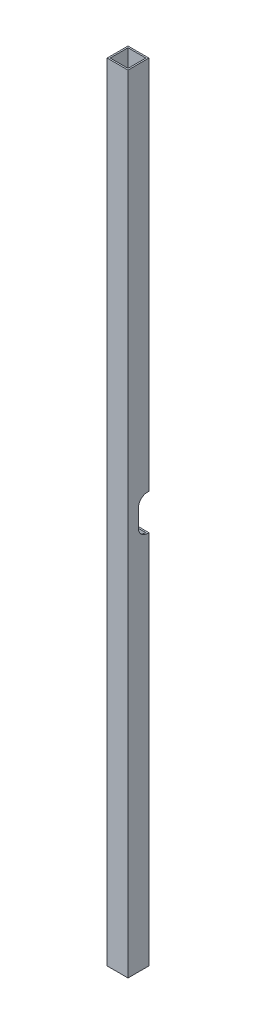
ISO-10303-21;
HEADER;
FILE_DESCRIPTION(('STEP AP214'),'2;1');
FILE_NAME('part.step','',(''),(''),'','','');
FILE_SCHEMA(('AUTOMOTIVE_DESIGN { 1 0 10303 214 1 1 1 1 }'));
ENDSEC;
DATA;
#1=APPLICATION_CONTEXT('core data for automotive mechanical design processes');
#2=APPLICATION_PROTOCOL_DEFINITION('international standard','automotive_design',2000,#1);
#3=PRODUCT_CONTEXT('',#1,'mechanical');
#4=PRODUCT('Part','Part','',(#3));
#5=PRODUCT_RELATED_PRODUCT_CATEGORY('part','',(#4));
#6=PRODUCT_DEFINITION_FORMATION('','',#4);
#7=PRODUCT_DEFINITION_CONTEXT('part definition',#1,'design');
#8=PRODUCT_DEFINITION('design','',#6,#7);
#9=PRODUCT_DEFINITION_SHAPE('','',#8);
#10=(LENGTH_UNIT() NAMED_UNIT(*) SI_UNIT(.MILLI.,.METRE.));
#11=(NAMED_UNIT(*) PLANE_ANGLE_UNIT() SI_UNIT($,.RADIAN.));
#12=(NAMED_UNIT(*) SI_UNIT($,.STERADIAN.) SOLID_ANGLE_UNIT());
#13=UNCERTAINTY_MEASURE_WITH_UNIT(LENGTH_MEASURE(1.E-05),#10,'distance_accuracy_value','');
#14=(GEOMETRIC_REPRESENTATION_CONTEXT(3) GLOBAL_UNCERTAINTY_ASSIGNED_CONTEXT((#13)) GLOBAL_UNIT_ASSIGNED_CONTEXT((#10,
#11,#12)) REPRESENTATION_CONTEXT('',''));
#15=CARTESIAN_POINT('',(0.,0.,0.));
#16=DIRECTION('',(0.,0.,1.));
#17=DIRECTION('',(1.,0.,0.));
#18=AXIS2_PLACEMENT_3D('',#15,#16,#17);
#19=CARTESIAN_POINT('',(657.225,-19.05,3.175));
#20=DIRECTION('',(1.,0.,0.));
#21=DIRECTION('',(0.,1.,0.));
#22=AXIS2_PLACEMENT_3D('',#19,#20,#21);
#23=CYLINDRICAL_SURFACE('',#22,19.05);
#24=DIRECTION('',(-1.,0.,0.));
#25=VECTOR('',#24,1.);
#26=CARTESIAN_POINT('',(657.225,-19.05,22.225));
#27=LINE('',#26,#25);
#28=CARTESIAN_POINT('',(704.85,-19.05,22.225));
#29=VERTEX_POINT('',#28);
#30=CARTESIAN_POINT('',(701.675,-19.05,22.225));
#31=VERTEX_POINT('',#30);
#32=EDGE_CURVE('E261',#29,#31,#27,.T.);
#33=ORIENTED_EDGE('',*,*,#32,.F.);
#34=CARTESIAN_POINT('',(704.85,-19.05,3.175));
#35=DIRECTION('',(1.,0.,0.));
#36=DIRECTION('',(0.,1.,0.));
#37=AXIS2_PLACEMENT_3D('',#34,#35,#36);
#38=CIRCLE('',#37,19.05);
#39=CARTESIAN_POINT('',(704.85,-38.1,3.175));
#40=VERTEX_POINT('',#39);
#41=EDGE_CURVE('E141',#40,#29,#38,.F.);
#42=ORIENTED_EDGE('',*,*,#41,.F.);
#43=DIRECTION('',(1.,0.,0.));
#44=VECTOR('',#43,1.);
#45=CARTESIAN_POINT('',(657.225,-38.1,3.175));
#46=LINE('',#45,#44);
#47=CARTESIAN_POINT('',(701.675,-38.1,3.175));
#48=VERTEX_POINT('',#47);
#49=EDGE_CURVE('E137',#48,#40,#46,.T.);
#50=ORIENTED_EDGE('',*,*,#49,.F.);
#51=CARTESIAN_POINT('',(701.675,-19.05,3.175));
#52=DIRECTION('',(1.,0.,0.));
#53=DIRECTION('',(0.,1.,0.));
#54=AXIS2_PLACEMENT_3D('',#51,#52,#53);
#55=CIRCLE('',#54,19.05);
#56=EDGE_CURVE('E17',#48,#31,#55,.F.);
#57=ORIENTED_EDGE('',*,*,#56,.T.);
#58=EDGE_LOOP('',(#33,#42,#50,#57));
#59=FACE_BOUND('',#58,.T.);
#60=ADVANCED_FACE('F14',(#59),#23,.F.);
#61=CARTESIAN_POINT('',(657.225,-2.9321578383444,22.225));
#62=DIRECTION('',(0.,0.,-1.));
#63=DIRECTION('',(-1.,0.,0.));
#64=AXIS2_PLACEMENT_3D('',#61,#62,#63);
#65=PLANE('',#64);
#66=DIRECTION('',(0.,1.,0.));
#67=VECTOR('',#66,1.);
#68=CARTESIAN_POINT('',(704.85,0.,22.225));
#69=LINE('',#68,#67);
#70=CARTESIAN_POINT('',(704.85,19.05,22.225));
#71=VERTEX_POINT('',#70);
#72=EDGE_CURVE('E206',#29,#71,#69,.T.);
#73=ORIENTED_EDGE('',*,*,#72,.F.);
#74=ORIENTED_EDGE('',*,*,#32,.T.);
#75=DIRECTION('',(0.,1.,0.));
#76=VECTOR('',#75,1.);
#77=CARTESIAN_POINT('',(701.675,0.,22.225));
#78=LINE('',#77,#76);
#79=CARTESIAN_POINT('',(701.675,19.05,22.225));
#80=VERTEX_POINT('',#79);
#81=EDGE_CURVE('E156',#31,#80,#78,.T.);
#82=ORIENTED_EDGE('',*,*,#81,.T.);
#83=DIRECTION('',(-1.,0.,0.));
#84=VECTOR('',#83,1.);
#85=CARTESIAN_POINT('',(657.225,19.05,22.225));
#86=LINE('',#85,#84);
#87=EDGE_CURVE('E147',#80,#71,#86,.F.);
#88=ORIENTED_EDGE('',*,*,#87,.T.);
#89=EDGE_LOOP('',(#73,#74,#82,#88));
#90=FACE_BOUND('',#89,.T.);
#91=ADVANCED_FACE('F392',(#90),#65,.T.);
#92=CARTESIAN_POINT('',(657.225,19.05,3.175));
#93=DIRECTION('',(-1.,0.,0.));
#94=DIRECTION('',(0.,-1.,0.));
#95=AXIS2_PLACEMENT_3D('',#92,#93,#94);
#96=CYLINDRICAL_SURFACE('',#95,19.05);
#97=DIRECTION('',(1.,0.,0.));
#98=VECTOR('',#97,1.);
#99=CARTESIAN_POINT('',(657.225,38.1,3.175));
#100=LINE('',#99,#98);
#101=CARTESIAN_POINT('',(701.675,38.1,3.175));
#102=VERTEX_POINT('',#101);
#103=CARTESIAN_POINT('',(704.85,38.1,3.175));
#104=VERTEX_POINT('',#103);
#105=EDGE_CURVE('E193',#102,#104,#100,.T.);
#106=ORIENTED_EDGE('',*,*,#105,.T.);
#107=CARTESIAN_POINT('',(704.85,19.05,3.175));
#108=DIRECTION('',(-1.,0.,0.));
#109=DIRECTION('',(0.,-1.,0.));
#110=AXIS2_PLACEMENT_3D('',#107,#108,#109);
#111=CIRCLE('',#110,19.05);
#112=EDGE_CURVE('E202',#71,#104,#111,.T.);
#113=ORIENTED_EDGE('',*,*,#112,.F.);
#114=ORIENTED_EDGE('',*,*,#87,.F.);
#115=CARTESIAN_POINT('',(701.675,19.05,3.175));
#116=DIRECTION('',(-1.,0.,0.));
#117=DIRECTION('',(0.,-1.,0.));
#118=AXIS2_PLACEMENT_3D('',#115,#116,#117);
#119=CIRCLE('',#118,19.05);
#120=EDGE_CURVE('E172',#80,#102,#119,.T.);
#121=ORIENTED_EDGE('',*,*,#120,.T.);
#122=EDGE_LOOP('',(#106,#113,#114,#121));
#123=FACE_BOUND('',#122,.T.);
#124=ADVANCED_FACE('F383',(#123),#96,.F.);
#125=CARTESIAN_POINT('',(352.425,0.,3.175));
#126=DIRECTION('',(0.,0.,1.));
#127=DIRECTION('',(1.,0.,0.));
#128=AXIS2_PLACEMENT_3D('',#125,#126,#127);
#129=PLANE('',#128);
#130=DIRECTION('',(1.,0.,0.));
#131=VECTOR('',#130,1.);
#132=CARTESIAN_POINT('',(682.625,838.2,3.175));
#133=LINE('',#132,#131);
#134=CARTESIAN_POINT('',(701.675,838.2,3.175));
#135=VERTEX_POINT('',#134);
#136=CARTESIAN_POINT('',(663.575,838.2,3.175));
#137=VERTEX_POINT('',#136);
#138=EDGE_CURVE('E187',#135,#137,#133,.F.);
#139=ORIENTED_EDGE('',*,*,#138,.T.);
#140=DIRECTION('',(0.,1.,0.));
#141=VECTOR('',#140,1.);
#142=CARTESIAN_POINT('',(663.575,0.,3.175));
#143=LINE('',#142,#141);
#144=CARTESIAN_POINT('',(663.575,38.1,3.175));
#145=VERTEX_POINT('',#144);
#146=EDGE_CURVE('E216',#145,#137,#143,.T.);
#147=ORIENTED_EDGE('',*,*,#146,.F.);
#148=DIRECTION('',(1.,0.,0.));
#149=VECTOR('',#148,1.);
#150=CARTESIAN_POINT('',(657.225,38.1,3.175));
#151=LINE('',#150,#149);
#152=EDGE_CURVE('E191',#145,#102,#151,.T.);
#153=ORIENTED_EDGE('',*,*,#152,.T.);
#154=DIRECTION('',(0.,1.,0.));
#155=VECTOR('',#154,1.);
#156=CARTESIAN_POINT('',(701.675,0.,3.175));
#157=LINE('',#156,#155);
#158=EDGE_CURVE('E170',#102,#135,#157,.T.);
#159=ORIENTED_EDGE('',*,*,#158,.T.);
#160=EDGE_LOOP('',(#139,#147,#153,#159));
#161=FACE_BOUND('',#160,.T.);
#162=ADVANCED_FACE('F381',(#161),#129,.T.);
#163=CARTESIAN_POINT('',(657.225,-38.1,10.495868107313));
#164=DIRECTION('',(0.,1.,0.));
#165=DIRECTION('',(0.,0.,1.));
#166=AXIS2_PLACEMENT_3D('',#163,#164,#165);
#167=PLANE('',#166);
#168=DIRECTION('',(0.,0.,1.));
#169=VECTOR('',#168,1.);
#170=CARTESIAN_POINT('',(660.4,-38.1,44.45));
#171=LINE('',#170,#169);
#172=CARTESIAN_POINT('',(660.4,-38.1,0.));
#173=VERTEX_POINT('',#172);
#174=CARTESIAN_POINT('',(660.4,-38.1,3.175));
#175=VERTEX_POINT('',#174);
#176=EDGE_CURVE('E201',#173,#175,#171,.T.);
#177=ORIENTED_EDGE('',*,*,#176,.T.);
#178=DIRECTION('',(1.,0.,0.));
#179=VECTOR('',#178,1.);
#180=CARTESIAN_POINT('',(657.225,-38.1,3.175));
#181=LINE('',#180,#179);
#182=CARTESIAN_POINT('',(663.575,-38.1,3.175));
#183=VERTEX_POINT('',#182);
#184=EDGE_CURVE('E146',#175,#183,#181,.T.);
#185=ORIENTED_EDGE('',*,*,#184,.T.);
#186=DIRECTION('',(1.,0.,0.));
#187=VECTOR('',#186,1.);
#188=CARTESIAN_POINT('',(352.425,-38.1,3.175));
#189=LINE('',#188,#187);
#190=EDGE_CURVE('E159',#48,#183,#189,.F.);
#191=ORIENTED_EDGE('',*,*,#190,.F.);
#192=ORIENTED_EDGE('',*,*,#49,.T.);
#193=DIRECTION('',(0.,0.,1.));
#194=VECTOR('',#193,1.);
#195=CARTESIAN_POINT('',(704.85,-38.1,44.45));
#196=LINE('',#195,#194);
#197=CARTESIAN_POINT('',(704.85,-38.1,0.));
#198=VERTEX_POINT('',#197);
#199=EDGE_CURVE('E208',#198,#40,#196,.T.);
#200=ORIENTED_EDGE('',*,*,#199,.F.);
#201=DIRECTION('',(1.,0.,0.));
#202=VECTOR('',#201,1.);
#203=CARTESIAN_POINT('',(352.425,-38.1,0.));
#204=LINE('',#203,#202);
#205=EDGE_CURVE('E157',#198,#173,#204,.F.);
#206=ORIENTED_EDGE('',*,*,#205,.T.);
#207=EDGE_LOOP('',(#177,#185,#191,#192,#200,#206));
#208=FACE_BOUND('',#207,.T.);
#209=ADVANCED_FACE('F160',(#208),#167,.T.);
#210=CARTESIAN_POINT('',(657.225,-19.05,3.175));
#211=DIRECTION('',(1.,0.,0.));
#212=DIRECTION('',(0.,1.,0.));
#213=AXIS2_PLACEMENT_3D('',#210,#211,#212);
#214=CYLINDRICAL_SURFACE('',#213,19.05);
#215=DIRECTION('',(-1.,0.,0.));
#216=VECTOR('',#215,1.);
#217=CARTESIAN_POINT('',(657.225,-19.05,22.225));
#218=LINE('',#217,#216);
#219=CARTESIAN_POINT('',(663.575,-19.05,22.225));
#220=VERTEX_POINT('',#219);
#221=CARTESIAN_POINT('',(660.4,-19.05,22.225));
#222=VERTEX_POINT('',#221);
#223=EDGE_CURVE('E239',#220,#222,#218,.T.);
#224=ORIENTED_EDGE('',*,*,#223,.F.);
#225=CARTESIAN_POINT('',(663.575,-19.05,3.175));
#226=DIRECTION('',(1.,0.,0.));
#227=DIRECTION('',(0.,1.,0.));
#228=AXIS2_PLACEMENT_3D('',#225,#226,#227);
#229=CIRCLE('',#228,19.05);
#230=EDGE_CURVE('E209',#183,#220,#229,.F.);
#231=ORIENTED_EDGE('',*,*,#230,.F.);
#232=ORIENTED_EDGE('',*,*,#184,.F.);
#233=CARTESIAN_POINT('',(660.4,-19.05,3.175));
#234=DIRECTION('',(1.,0.,0.));
#235=DIRECTION('',(0.,1.,0.));
#236=AXIS2_PLACEMENT_3D('',#233,#234,#235);
#237=CIRCLE('',#236,19.05);
#238=EDGE_CURVE('E199',#175,#222,#237,.F.);
#239=ORIENTED_EDGE('',*,*,#238,.T.);
#240=EDGE_LOOP('',(#224,#231,#232,#239));
#241=FACE_BOUND('',#240,.T.);
#242=ADVANCED_FACE('F390',(#241),#214,.F.);
#243=CARTESIAN_POINT('',(657.225,-2.9321578383444,22.225));
#244=DIRECTION('',(0.,0.,-1.));
#245=DIRECTION('',(-1.,0.,0.));
#246=AXIS2_PLACEMENT_3D('',#243,#244,#245);
#247=PLANE('',#246);
#248=DIRECTION('',(0.,1.,0.));
#249=VECTOR('',#248,1.);
#250=CARTESIAN_POINT('',(663.575,0.,22.225));
#251=LINE('',#250,#249);
#252=CARTESIAN_POINT('',(663.575,19.05,22.225));
#253=VERTEX_POINT('',#252);
#254=EDGE_CURVE('E164',#220,#253,#251,.T.);
#255=ORIENTED_EDGE('',*,*,#254,.F.);
#256=ORIENTED_EDGE('',*,*,#223,.T.);
#257=DIRECTION('',(0.,1.,0.));
#258=VECTOR('',#257,1.);
#259=CARTESIAN_POINT('',(660.4,0.,22.225));
#260=LINE('',#259,#258);
#261=CARTESIAN_POINT('',(660.4,19.05,22.225));
#262=VERTEX_POINT('',#261);
#263=EDGE_CURVE('E198',#222,#262,#260,.T.);
#264=ORIENTED_EDGE('',*,*,#263,.T.);
#265=DIRECTION('',(-1.,0.,0.));
#266=VECTOR('',#265,1.);
#267=CARTESIAN_POINT('',(657.225,19.05,22.225));
#268=LINE('',#267,#266);
#269=EDGE_CURVE('E227',#262,#253,#268,.F.);
#270=ORIENTED_EDGE('',*,*,#269,.T.);
#271=EDGE_LOOP('',(#255,#256,#264,#270));
#272=FACE_BOUND('',#271,.T.);
#273=ADVANCED_FACE('F330',(#272),#247,.T.);
#274=CARTESIAN_POINT('',(657.225,19.05,3.175));
#275=DIRECTION('',(-1.,0.,0.));
#276=DIRECTION('',(0.,-1.,0.));
#277=AXIS2_PLACEMENT_3D('',#274,#275,#276);
#278=CYLINDRICAL_SURFACE('',#277,19.05);
#279=DIRECTION('',(1.,0.,0.));
#280=VECTOR('',#279,1.);
#281=CARTESIAN_POINT('',(657.225,38.1,3.175));
#282=LINE('',#281,#280);
#283=CARTESIAN_POINT('',(660.4,38.1,3.175));
#284=VERTEX_POINT('',#283);
#285=EDGE_CURVE('E194',#284,#145,#282,.T.);
#286=ORIENTED_EDGE('',*,*,#285,.T.);
#287=CARTESIAN_POINT('',(663.575,19.05,3.175));
#288=DIRECTION('',(-1.,0.,0.));
#289=DIRECTION('',(0.,-1.,0.));
#290=AXIS2_PLACEMENT_3D('',#287,#288,#289);
#291=CIRCLE('',#290,19.05);
#292=EDGE_CURVE('E214',#253,#145,#291,.T.);
#293=ORIENTED_EDGE('',*,*,#292,.F.);
#294=ORIENTED_EDGE('',*,*,#269,.F.);
#295=CARTESIAN_POINT('',(660.4,19.05,3.175));
#296=DIRECTION('',(-1.,0.,0.));
#297=DIRECTION('',(0.,-1.,0.));
#298=AXIS2_PLACEMENT_3D('',#295,#296,#297);
#299=CIRCLE('',#298,19.05);
#300=EDGE_CURVE('E195',#262,#284,#299,.T.);
#301=ORIENTED_EDGE('',*,*,#300,.T.);
#302=EDGE_LOOP('',(#286,#293,#294,#301));
#303=FACE_BOUND('',#302,.T.);
#304=ADVANCED_FACE('F335',(#303),#278,.F.);
#305=CARTESIAN_POINT('',(657.225,38.1,10.4958681073129));
#306=DIRECTION('',(0.,1.,0.));
#307=DIRECTION('',(0.,0.,1.));
#308=AXIS2_PLACEMENT_3D('',#305,#306,#307);
#309=PLANE('',#308);
#310=ORIENTED_EDGE('',*,*,#105,.F.);
#311=ORIENTED_EDGE('',*,*,#152,.F.);
#312=ORIENTED_EDGE('',*,*,#285,.F.);
#313=DIRECTION('',(0.,0.,1.));
#314=VECTOR('',#313,1.);
#315=CARTESIAN_POINT('',(660.4,38.1,44.45));
#316=LINE('',#315,#314);
#317=CARTESIAN_POINT('',(660.4,38.1,0.));
#318=VERTEX_POINT('',#317);
#319=EDGE_CURVE('E197',#284,#318,#316,.F.);
#320=ORIENTED_EDGE('',*,*,#319,.T.);
#321=DIRECTION('',(1.,0.,0.));
#322=VECTOR('',#321,1.);
#323=CARTESIAN_POINT('',(352.425,38.1,0.));
#324=LINE('',#323,#322);
#325=CARTESIAN_POINT('',(704.85,38.1,0.));
#326=VERTEX_POINT('',#325);
#327=EDGE_CURVE('E228',#318,#326,#324,.T.);
#328=ORIENTED_EDGE('',*,*,#327,.T.);
#329=DIRECTION('',(0.,0.,1.));
#330=VECTOR('',#329,1.);
#331=CARTESIAN_POINT('',(704.85,38.1,44.45));
#332=LINE('',#331,#330);
#333=EDGE_CURVE('E275',#104,#326,#332,.F.);
#334=ORIENTED_EDGE('',*,*,#333,.F.);
#335=EDGE_LOOP('',(#310,#311,#312,#320,#328,#334));
#336=FACE_BOUND('',#335,.T.);
#337=ADVANCED_FACE('F340',(#336),#309,.F.);
#338=CARTESIAN_POINT('',(352.425,0.,0.));
#339=DIRECTION('',(0.,0.,1.));
#340=DIRECTION('',(1.,0.,0.));
#341=AXIS2_PLACEMENT_3D('',#338,#339,#340);
#342=PLANE('',#341);
#343=DIRECTION('',(0.,1.,0.));
#344=VECTOR('',#343,1.);
#345=CARTESIAN_POINT('',(660.4,0.,0.));
#346=LINE('',#345,#344);
#347=CARTESIAN_POINT('',(660.4,838.2,0.));
#348=VERTEX_POINT('',#347);
#349=EDGE_CURVE('E232',#318,#348,#346,.T.);
#350=ORIENTED_EDGE('',*,*,#349,.T.);
#351=DIRECTION('',(1.,0.,0.));
#352=VECTOR('',#351,1.);
#353=CARTESIAN_POINT('',(682.625,838.2,0.));
#354=LINE('',#353,#352);
#355=CARTESIAN_POINT('',(704.85,838.2,0.));
#356=VERTEX_POINT('',#355);
#357=EDGE_CURVE('E291',#348,#356,#354,.T.);
#358=ORIENTED_EDGE('',*,*,#357,.T.);
#359=DIRECTION('',(0.,1.,0.));
#360=VECTOR('',#359,1.);
#361=CARTESIAN_POINT('',(704.85,0.,0.));
#362=LINE('',#361,#360);
#363=EDGE_CURVE('E266',#326,#356,#362,.T.);
#364=ORIENTED_EDGE('',*,*,#363,.F.);
#365=ORIENTED_EDGE('',*,*,#327,.F.);
#366=EDGE_LOOP('',(#350,#358,#364,#365));
#367=FACE_BOUND('',#366,.T.);
#368=ADVANCED_FACE('F420',(#367),#342,.F.);
#369=CARTESIAN_POINT('',(352.425,0.,0.));
#370=DIRECTION('',(0.,0.,1.));
#371=DIRECTION('',(1.,0.,0.));
#372=AXIS2_PLACEMENT_3D('',#369,#370,#371);
#373=PLANE('',#372);
#374=ORIENTED_EDGE('',*,*,#205,.F.);
#375=DIRECTION('',(0.,1.,0.));
#376=VECTOR('',#375,1.);
#377=CARTESIAN_POINT('',(704.85,0.,0.));
#378=LINE('',#377,#376);
#379=CARTESIAN_POINT('',(704.85,-838.2,0.));
#380=VERTEX_POINT('',#379);
#381=EDGE_CURVE('E263',#380,#198,#378,.T.);
#382=ORIENTED_EDGE('',*,*,#381,.F.);
#383=DIRECTION('',(1.,0.,0.));
#384=VECTOR('',#383,1.);
#385=CARTESIAN_POINT('',(682.625,-838.2,0.));
#386=LINE('',#385,#384);
#387=CARTESIAN_POINT('',(660.4,-838.2,0.));
#388=VERTEX_POINT('',#387);
#389=EDGE_CURVE('E235',#388,#380,#386,.T.);
#390=ORIENTED_EDGE('',*,*,#389,.F.);
#391=DIRECTION('',(0.,1.,0.));
#392=VECTOR('',#391,1.);
#393=CARTESIAN_POINT('',(660.4,0.,0.));
#394=LINE('',#393,#392);
#395=EDGE_CURVE('E243',#388,#173,#394,.T.);
#396=ORIENTED_EDGE('',*,*,#395,.T.);
#397=EDGE_LOOP('',(#374,#382,#390,#396));
#398=FACE_BOUND('',#397,.T.);
#399=ADVANCED_FACE('F417',(#398),#373,.F.);
#400=CARTESIAN_POINT('',(701.675,0.,44.45));
#401=DIRECTION('',(1.,0.,0.));
#402=DIRECTION('',(0.,1.,0.));
#403=AXIS2_PLACEMENT_3D('',#400,#401,#402);
#404=PLANE('',#403);
#405=ORIENTED_EDGE('',*,*,#120,.F.);
#406=ORIENTED_EDGE('',*,*,#81,.F.);
#407=ORIENTED_EDGE('',*,*,#56,.F.);
#408=DIRECTION('',(0.,1.,0.));
#409=VECTOR('',#408,1.);
#410=CARTESIAN_POINT('',(701.675,0.,3.175));
#411=LINE('',#410,#409);
#412=CARTESIAN_POINT('',(701.675,-838.2,3.175));
#413=VERTEX_POINT('',#412);
#414=EDGE_CURVE('E154',#413,#48,#411,.T.);
#415=ORIENTED_EDGE('',*,*,#414,.F.);
#416=DIRECTION('',(0.,0.,-1.));
#417=VECTOR('',#416,1.);
#418=CARTESIAN_POINT('',(701.675,-838.2,44.45));
#419=LINE('',#418,#417);
#420=CARTESIAN_POINT('',(701.675,-838.2,41.275));
#421=VERTEX_POINT('',#420);
#422=EDGE_CURVE('E180',#421,#413,#419,.T.);
#423=ORIENTED_EDGE('',*,*,#422,.F.);
#424=DIRECTION('',(0.,1.,0.));
#425=VECTOR('',#424,1.);
#426=CARTESIAN_POINT('',(701.675,0.,41.275));
#427=LINE('',#426,#425);
#428=CARTESIAN_POINT('',(701.675,838.2,41.275));
#429=VERTEX_POINT('',#428);
#430=EDGE_CURVE('E312',#421,#429,#427,.T.);
#431=ORIENTED_EDGE('',*,*,#430,.T.);
#432=DIRECTION('',(0.,0.,-1.));
#433=VECTOR('',#432,1.);
#434=CARTESIAN_POINT('',(701.675,838.2,44.45));
#435=LINE('',#434,#433);
#436=EDGE_CURVE('E184',#429,#135,#435,.T.);
#437=ORIENTED_EDGE('',*,*,#436,.T.);
#438=ORIENTED_EDGE('',*,*,#158,.F.);
#439=EDGE_LOOP('',(#405,#406,#407,#415,#423,#431,#437,#438));
#440=FACE_BOUND('',#439,.T.);
#441=ADVANCED_FACE('F152',(#440),#404,.F.);
#442=CARTESIAN_POINT('',(352.425,0.,3.175));
#443=DIRECTION('',(0.,0.,1.));
#444=DIRECTION('',(1.,0.,0.));
#445=AXIS2_PLACEMENT_3D('',#442,#443,#444);
#446=PLANE('',#445);
#447=DIRECTION('',(0.,1.,0.));
#448=VECTOR('',#447,1.);
#449=CARTESIAN_POINT('',(663.575,0.,3.175));
#450=LINE('',#449,#448);
#451=CARTESIAN_POINT('',(663.575,-838.2,3.175));
#452=VERTEX_POINT('',#451);
#453=EDGE_CURVE('E213',#452,#183,#450,.T.);
#454=ORIENTED_EDGE('',*,*,#453,.F.);
#455=DIRECTION('',(1.,0.,0.));
#456=VECTOR('',#455,1.);
#457=CARTESIAN_POINT('',(682.625,-838.2,3.175));
#458=LINE('',#457,#456);
#459=EDGE_CURVE('E168',#413,#452,#458,.F.);
#460=ORIENTED_EDGE('',*,*,#459,.F.);
#461=ORIENTED_EDGE('',*,*,#414,.T.);
#462=ORIENTED_EDGE('',*,*,#190,.T.);
#463=EDGE_LOOP('',(#454,#460,#461,#462));
#464=FACE_BOUND('',#463,.T.);
#465=ADVANCED_FACE('F166',(#464),#446,.T.);
#466=CARTESIAN_POINT('',(663.575,0.,44.45));
#467=DIRECTION('',(1.,0.,0.));
#468=DIRECTION('',(0.,1.,0.));
#469=AXIS2_PLACEMENT_3D('',#466,#467,#468);
#470=PLANE('',#469);
#471=ORIENTED_EDGE('',*,*,#453,.T.);
#472=ORIENTED_EDGE('',*,*,#230,.T.);
#473=ORIENTED_EDGE('',*,*,#254,.T.);
#474=ORIENTED_EDGE('',*,*,#292,.T.);
#475=ORIENTED_EDGE('',*,*,#146,.T.);
#476=DIRECTION('',(0.,0.,-1.));
#477=VECTOR('',#476,1.);
#478=CARTESIAN_POINT('',(663.575,838.2,44.45));
#479=LINE('',#478,#477);
#480=CARTESIAN_POINT('',(663.575,838.2,41.275));
#481=VERTEX_POINT('',#480);
#482=EDGE_CURVE('E290',#137,#481,#479,.F.);
#483=ORIENTED_EDGE('',*,*,#482,.T.);
#484=DIRECTION('',(0.,1.,0.));
#485=VECTOR('',#484,1.);
#486=CARTESIAN_POINT('',(663.575,0.,41.275));
#487=LINE('',#486,#485);
#488=CARTESIAN_POINT('',(663.575,-838.2,41.275));
#489=VERTEX_POINT('',#488);
#490=EDGE_CURVE('E212',#481,#489,#487,.F.);
#491=ORIENTED_EDGE('',*,*,#490,.T.);
#492=DIRECTION('',(0.,0.,-1.));
#493=VECTOR('',#492,1.);
#494=CARTESIAN_POINT('',(663.575,-838.2,44.45));
#495=LINE('',#494,#493);
#496=EDGE_CURVE('E278',#452,#489,#495,.F.);
#497=ORIENTED_EDGE('',*,*,#496,.F.);
#498=EDGE_LOOP('',(#471,#472,#473,#474,#475,#483,#491,#497));
#499=FACE_BOUND('',#498,.T.);
#500=ADVANCED_FACE('F326',(#499),#470,.T.);
#501=CARTESIAN_POINT('',(352.425,0.,41.275));
#502=DIRECTION('',(0.,0.,1.));
#503=DIRECTION('',(1.,0.,0.));
#504=AXIS2_PLACEMENT_3D('',#501,#502,#503);
#505=PLANE('',#504);
#506=DIRECTION('',(1.,0.,0.));
#507=VECTOR('',#506,1.);
#508=CARTESIAN_POINT('',(682.625,-838.2,41.275));
#509=LINE('',#508,#507);
#510=EDGE_CURVE('E281',#489,#421,#509,.T.);
#511=ORIENTED_EDGE('',*,*,#510,.F.);
#512=ORIENTED_EDGE('',*,*,#490,.F.);
#513=DIRECTION('',(1.,0.,0.));
#514=VECTOR('',#513,1.);
#515=CARTESIAN_POINT('',(682.625,838.2,41.275));
#516=LINE('',#515,#514);
#517=EDGE_CURVE('E188',#481,#429,#516,.T.);
#518=ORIENTED_EDGE('',*,*,#517,.T.);
#519=ORIENTED_EDGE('',*,*,#430,.F.);
#520=EDGE_LOOP('',(#511,#512,#518,#519));
#521=FACE_BOUND('',#520,.T.);
#522=ADVANCED_FACE('F374',(#521),#505,.F.);
#523=CARTESIAN_POINT('',(704.85,0.,44.45));
#524=DIRECTION('',(1.,0.,0.));
#525=DIRECTION('',(0.,1.,0.));
#526=AXIS2_PLACEMENT_3D('',#523,#524,#525);
#527=PLANE('',#526);
#528=ORIENTED_EDGE('',*,*,#72,.T.);
#529=ORIENTED_EDGE('',*,*,#112,.T.);
#530=ORIENTED_EDGE('',*,*,#333,.T.);
#531=ORIENTED_EDGE('',*,*,#363,.T.);
#532=DIRECTION('',(0.,0.,-1.));
#533=VECTOR('',#532,1.);
#534=CARTESIAN_POINT('',(704.85,838.2,44.45));
#535=LINE('',#534,#533);
#536=CARTESIAN_POINT('',(704.85,838.2,44.45));
#537=VERTEX_POINT('',#536);
#538=EDGE_CURVE('E205',#356,#537,#535,.F.);
#539=ORIENTED_EDGE('',*,*,#538,.T.);
#540=DIRECTION('',(0.,1.,0.));
#541=VECTOR('',#540,1.);
#542=CARTESIAN_POINT('',(704.85,0.,44.45));
#543=LINE('',#542,#541);
#544=CARTESIAN_POINT('',(704.85,-838.2,44.45));
#545=VERTEX_POINT('',#544);
#546=EDGE_CURVE('E364',#545,#537,#543,.T.);
#547=ORIENTED_EDGE('',*,*,#546,.F.);
#548=DIRECTION('',(0.,0.,-1.));
#549=VECTOR('',#548,1.);
#550=CARTESIAN_POINT('',(704.85,-838.2,44.45));
#551=LINE('',#550,#549);
#552=EDGE_CURVE('E254',#380,#545,#551,.F.);
#553=ORIENTED_EDGE('',*,*,#552,.F.);
#554=ORIENTED_EDGE('',*,*,#381,.T.);
#555=ORIENTED_EDGE('',*,*,#199,.T.);
#556=ORIENTED_EDGE('',*,*,#41,.T.);
#557=EDGE_LOOP('',(#528,#529,#530,#531,#539,#547,#553,#554,#555,#556));
#558=FACE_BOUND('',#557,.T.);
#559=ADVANCED_FACE('F405',(#558),#527,.T.);
#560=CARTESIAN_POINT('',(682.625,838.2,44.45));
#561=DIRECTION('',(0.,-1.,0.));
#562=DIRECTION('',(0.,0.,-1.));
#563=AXIS2_PLACEMENT_3D('',#560,#561,#562);
#564=PLANE('',#563);
#565=ORIENTED_EDGE('',*,*,#436,.F.);
#566=ORIENTED_EDGE('',*,*,#517,.F.);
#567=ORIENTED_EDGE('',*,*,#482,.F.);
#568=ORIENTED_EDGE('',*,*,#138,.F.);
#569=EDGE_LOOP('',(#565,#566,#567,#568));
#570=FACE_BOUND('',#569,.T.);
#571=DIRECTION('',(0.,0.,1.));
#572=VECTOR('',#571,1.);
#573=CARTESIAN_POINT('',(660.4,838.2,44.45));
#574=LINE('',#573,#572);
#575=CARTESIAN_POINT('',(660.4,838.2,44.45));
#576=VERTEX_POINT('',#575);
#577=EDGE_CURVE('E246',#348,#576,#574,.T.);
#578=ORIENTED_EDGE('',*,*,#577,.T.);
#579=DIRECTION('',(1.,0.,0.));
#580=VECTOR('',#579,1.);
#581=CARTESIAN_POINT('',(352.425,838.2,44.45));
#582=LINE('',#581,#580);
#583=EDGE_CURVE('E358',#537,#576,#582,.F.);
#584=ORIENTED_EDGE('',*,*,#583,.F.);
#585=ORIENTED_EDGE('',*,*,#538,.F.);
#586=ORIENTED_EDGE('',*,*,#357,.F.);
#587=EDGE_LOOP('',(#578,#584,#585,#586));
#588=FACE_BOUND('',#587,.T.);
#589=ADVANCED_FACE('F356',(#570,#588),#564,.F.);
#590=CARTESIAN_POINT('',(660.4,0.,44.45));
#591=DIRECTION('',(1.,0.,0.));
#592=DIRECTION('',(0.,1.,0.));
#593=AXIS2_PLACEMENT_3D('',#590,#591,#592);
#594=PLANE('',#593);
#595=ORIENTED_EDGE('',*,*,#319,.F.);
#596=ORIENTED_EDGE('',*,*,#300,.F.);
#597=ORIENTED_EDGE('',*,*,#263,.F.);
#598=ORIENTED_EDGE('',*,*,#238,.F.);
#599=ORIENTED_EDGE('',*,*,#176,.F.);
#600=ORIENTED_EDGE('',*,*,#395,.F.);
#601=DIRECTION('',(0.,0.,-1.));
#602=VECTOR('',#601,1.);
#603=CARTESIAN_POINT('',(660.4,-838.2,44.45));
#604=LINE('',#603,#602);
#605=CARTESIAN_POINT('',(660.4,-838.2,44.45));
#606=VERTEX_POINT('',#605);
#607=EDGE_CURVE('E32',#606,#388,#604,.T.);
#608=ORIENTED_EDGE('',*,*,#607,.F.);
#609=DIRECTION('',(0.,1.,0.));
#610=VECTOR('',#609,1.);
#611=CARTESIAN_POINT('',(660.4,0.,44.45));
#612=LINE('',#611,#610);
#613=EDGE_CURVE('E23',#576,#606,#612,.F.);
#614=ORIENTED_EDGE('',*,*,#613,.F.);
#615=ORIENTED_EDGE('',*,*,#577,.F.);
#616=ORIENTED_EDGE('',*,*,#349,.F.);
#617=EDGE_LOOP('',(#595,#596,#597,#598,#599,#600,#608,#614,#615,#616));
#618=FACE_BOUND('',#617,.T.);
#619=ADVANCED_FACE('F343',(#618),#594,.F.);
#620=CARTESIAN_POINT('',(682.625,-838.2,44.45));
#621=DIRECTION('',(0.,-1.,0.));
#622=DIRECTION('',(0.,0.,-1.));
#623=AXIS2_PLACEMENT_3D('',#620,#621,#622);
#624=PLANE('',#623);
#625=ORIENTED_EDGE('',*,*,#496,.T.);
#626=ORIENTED_EDGE('',*,*,#510,.T.);
#627=ORIENTED_EDGE('',*,*,#422,.T.);
#628=ORIENTED_EDGE('',*,*,#459,.T.);
#629=EDGE_LOOP('',(#625,#626,#627,#628));
#630=FACE_BOUND('',#629,.T.);
#631=DIRECTION('',(1.,0.,0.));
#632=VECTOR('',#631,1.);
#633=CARTESIAN_POINT('',(352.425,-838.2,44.45));
#634=LINE('',#633,#632);
#635=EDGE_CURVE('E9',#606,#545,#634,.T.);
#636=ORIENTED_EDGE('',*,*,#635,.F.);
#637=ORIENTED_EDGE('',*,*,#607,.T.);
#638=ORIENTED_EDGE('',*,*,#389,.T.);
#639=ORIENTED_EDGE('',*,*,#552,.T.);
#640=EDGE_LOOP('',(#636,#637,#638,#639));
#641=FACE_BOUND('',#640,.T.);
#642=ADVANCED_FACE('F369',(#630,#641),#624,.T.);
#643=CARTESIAN_POINT('',(352.425,0.,44.45));
#644=DIRECTION('',(0.,0.,1.));
#645=DIRECTION('',(1.,0.,0.));
#646=AXIS2_PLACEMENT_3D('',#643,#644,#645);
#647=PLANE('',#646);
#648=ORIENTED_EDGE('',*,*,#613,.T.);
#649=ORIENTED_EDGE('',*,*,#635,.T.);
#650=ORIENTED_EDGE('',*,*,#546,.T.);
#651=ORIENTED_EDGE('',*,*,#583,.T.);
#652=EDGE_LOOP('',(#648,#649,#650,#651));
#653=FACE_BOUND('',#652,.T.);
#654=ADVANCED_FACE('F363',(#653),#647,.T.);
#655=CLOSED_SHELL('',(#60,#91,#124,#162,#209,#242,#273,#304,#337,#368,#399,#441,#465,#500,#522,
#559,#589,#619,#642,#654));
#656=MANIFOLD_SOLID_BREP('B1',#655);
#657=ADVANCED_BREP_SHAPE_REPRESENTATION('',(#18,#656),#14);
#658=SHAPE_DEFINITION_REPRESENTATION(#9,#657);
ENDSEC;
END-ISO-10303-21;
